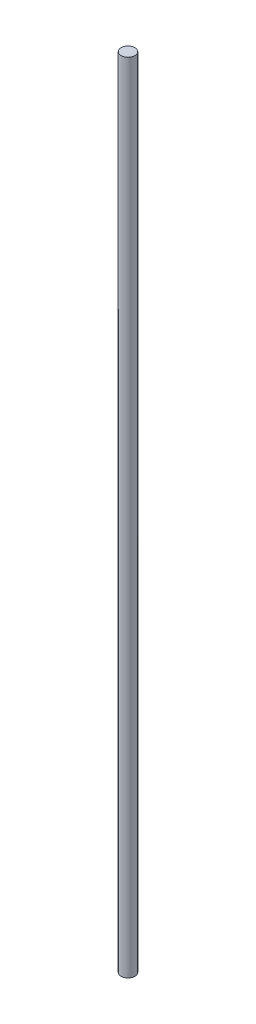
ISO-10303-21;
HEADER;
FILE_DESCRIPTION(('STEP AP214'),'2;1');
FILE_NAME('part.step','',(''),(''),'','','');
FILE_SCHEMA(('AUTOMOTIVE_DESIGN { 1 0 10303 214 1 1 1 1 }'));
ENDSEC;
DATA;
#1=APPLICATION_CONTEXT('core data for automotive mechanical design processes');
#2=APPLICATION_PROTOCOL_DEFINITION('international standard','automotive_design',2000,#1);
#3=PRODUCT_CONTEXT('',#1,'mechanical');
#4=PRODUCT('Part','Part','',(#3));
#5=PRODUCT_RELATED_PRODUCT_CATEGORY('part','',(#4));
#6=PRODUCT_DEFINITION_FORMATION('','',#4);
#7=PRODUCT_DEFINITION_CONTEXT('part definition',#1,'design');
#8=PRODUCT_DEFINITION('design','',#6,#7);
#9=PRODUCT_DEFINITION_SHAPE('','',#8);
#10=(LENGTH_UNIT() NAMED_UNIT(*) SI_UNIT(.MILLI.,.METRE.));
#11=(NAMED_UNIT(*) PLANE_ANGLE_UNIT() SI_UNIT($,.RADIAN.));
#12=(NAMED_UNIT(*) SI_UNIT($,.STERADIAN.) SOLID_ANGLE_UNIT());
#13=UNCERTAINTY_MEASURE_WITH_UNIT(LENGTH_MEASURE(1.E-05),#10,'distance_accuracy_value','');
#14=(GEOMETRIC_REPRESENTATION_CONTEXT(3) GLOBAL_UNCERTAINTY_ASSIGNED_CONTEXT((#13)) GLOBAL_UNIT_ASSIGNED_CONTEXT((#10,
#11,#12)) REPRESENTATION_CONTEXT('',''));
#15=CARTESIAN_POINT('',(0.,0.,0.));
#16=DIRECTION('',(0.,0.,1.));
#17=DIRECTION('',(1.,0.,0.));
#18=AXIS2_PLACEMENT_3D('',#15,#16,#17);
#19=CARTESIAN_POINT('',(0.,550.,0.));
#20=DIRECTION('',(0.,-1.,0.));
#21=DIRECTION('',(0.,0.,-1.));
#22=AXIS2_PLACEMENT_3D('',#19,#20,#21);
#23=PLANE('',#22);
#24=CARTESIAN_POINT('',(0.,550.,0.));
#25=DIRECTION('',(0.,-1.,0.));
#26=DIRECTION('',(0.,0.,-1.));
#27=AXIS2_PLACEMENT_3D('',#24,#25,#26);
#28=CIRCLE('',#27,4.76250000000002);
#29=CARTESIAN_POINT('',(0.,550.,-4.76250000000002));
#30=VERTEX_POINT('',#29);
#31=EDGE_CURVE('E10',#30,#30,#28,.T.);
#32=ORIENTED_EDGE('',*,*,#31,.F.);
#33=EDGE_LOOP('',(#32));
#34=FACE_BOUND('',#33,.T.);
#35=ADVANCED_FACE('F37',(#34),#23,.F.);
#36=CARTESIAN_POINT('',(0.,0.,0.));
#37=DIRECTION('',(0.,-1.,0.));
#38=DIRECTION('',(0.,0.,-1.));
#39=AXIS2_PLACEMENT_3D('',#36,#37,#38);
#40=CYLINDRICAL_SURFACE('',#39,4.76250000000001);
#41=CARTESIAN_POINT('',(0.,-1.11022302462516E-13,0.));
#42=DIRECTION('',(0.,-1.,0.));
#43=DIRECTION('',(0.,0.,-1.));
#44=AXIS2_PLACEMENT_3D('',#41,#42,#43);
#45=CIRCLE('',#44,4.7625);
#46=CARTESIAN_POINT('',(0.,-1.11022302462516E-13,-4.7625));
#47=VERTEX_POINT('',#46);
#48=EDGE_CURVE('E43',#47,#47,#45,.T.);
#49=ORIENTED_EDGE('',*,*,#48,.F.);
#50=EDGE_LOOP('',(#49));
#51=FACE_BOUND('',#50,.T.);
#52=ORIENTED_EDGE('',*,*,#31,.T.);
#53=EDGE_LOOP('',(#52));
#54=FACE_BOUND('',#53,.T.);
#55=ADVANCED_FACE('F51',(#51,#54),#40,.T.);
#56=CARTESIAN_POINT('',(0.,0.,0.));
#57=DIRECTION('',(0.,1.,0.));
#58=DIRECTION('',(0.,0.,1.));
#59=AXIS2_PLACEMENT_3D('',#56,#57,#58);
#60=PLANE('',#59);
#61=ORIENTED_EDGE('',*,*,#48,.T.);
#62=EDGE_LOOP('',(#61));
#63=FACE_BOUND('',#62,.T.);
#64=ADVANCED_FACE('F49',(#63),#60,.F.);
#65=CLOSED_SHELL('',(#35,#55,#64));
#66=MANIFOLD_SOLID_BREP('B2',#65);
#67=ADVANCED_BREP_SHAPE_REPRESENTATION('',(#18,#66),#14);
#68=SHAPE_DEFINITION_REPRESENTATION(#9,#67);
ENDSEC;
END-ISO-10303-21;
